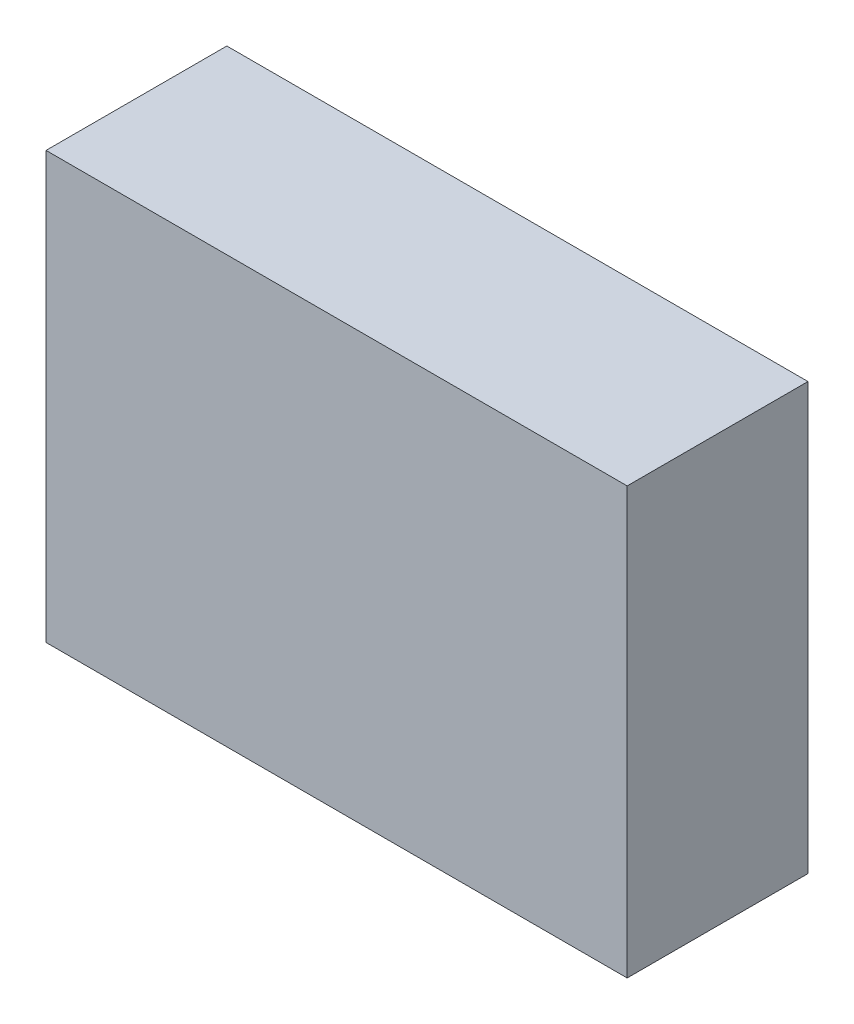
ISO-10303-21;
HEADER;
FILE_DESCRIPTION(('STEP AP214'),'2;1');
FILE_NAME('part.step','',(''),(''),'','','');
FILE_SCHEMA(('AUTOMOTIVE_DESIGN { 1 0 10303 214 1 1 1 1 }'));
ENDSEC;
DATA;
#1=APPLICATION_CONTEXT('core data for automotive mechanical design processes');
#2=APPLICATION_PROTOCOL_DEFINITION('international standard','automotive_design',2000,#1);
#3=PRODUCT_CONTEXT('',#1,'mechanical');
#4=PRODUCT('Part','Part','',(#3));
#5=PRODUCT_RELATED_PRODUCT_CATEGORY('part','',(#4));
#6=PRODUCT_DEFINITION_FORMATION('','',#4);
#7=PRODUCT_DEFINITION_CONTEXT('part definition',#1,'design');
#8=PRODUCT_DEFINITION('design','',#6,#7);
#9=PRODUCT_DEFINITION_SHAPE('','',#8);
#10=(LENGTH_UNIT() NAMED_UNIT(*) SI_UNIT(.MILLI.,.METRE.));
#11=(NAMED_UNIT(*) PLANE_ANGLE_UNIT() SI_UNIT($,.RADIAN.));
#12=(NAMED_UNIT(*) SI_UNIT($,.STERADIAN.) SOLID_ANGLE_UNIT());
#13=UNCERTAINTY_MEASURE_WITH_UNIT(LENGTH_MEASURE(1.E-05),#10,'distance_accuracy_value','');
#14=(GEOMETRIC_REPRESENTATION_CONTEXT(3) GLOBAL_UNCERTAINTY_ASSIGNED_CONTEXT((#13)) GLOBAL_UNIT_ASSIGNED_CONTEXT((#10,
#11,#12)) REPRESENTATION_CONTEXT('',''));
#15=CARTESIAN_POINT('',(0.,0.,0.));
#16=DIRECTION('',(0.,0.,1.));
#17=DIRECTION('',(1.,0.,0.));
#18=AXIS2_PLACEMENT_3D('',#15,#16,#17);
#19=CARTESIAN_POINT('',(-1.12500408197864,-0.824986841933026,-2.84112203121185));
#20=DIRECTION('',(-4.37113882867379E-08,-1.,0.));
#21=DIRECTION('',(1.,-4.37113882867379E-08,0.));
#22=AXIS2_PLACEMENT_3D('',#19,#20,#21);
#23=PLANE('',#22);
#24=DIRECTION('',(0.999999999999999,-4.37113882867379E-08,0.));
#25=VECTOR('',#24,1.);
#26=CARTESIAN_POINT('',(-1.12500408197864,-0.824986841933026,-2.84112203121185));
#27=LINE('',#26,#25);
#28=CARTESIAN_POINT('',(-1.12500408197864,-0.824986841933026,-2.84112203121185));
#29=VERTEX_POINT('',#28);
#30=CARTESIAN_POINT('',(1.12499591802136,-0.824986940283623,-2.84112203121185));
#31=VERTEX_POINT('',#30);
#32=EDGE_CURVE('E11',#29,#31,#27,.T.);
#33=ORIENTED_EDGE('',*,*,#32,.T.);
#34=DIRECTION('',(0.,0.,1.));
#35=VECTOR('',#34,1.);
#36=CARTESIAN_POINT('',(1.12499591802136,-0.824986940283649,-2.84112203121185));
#37=LINE('',#36,#35);
#38=CARTESIAN_POINT('',(1.12499591802136,-0.824986940283623,-2.14112091064453));
#39=VERTEX_POINT('',#38);
#40=EDGE_CURVE('E88',#31,#39,#37,.T.);
#41=ORIENTED_EDGE('',*,*,#40,.T.);
#42=DIRECTION('',(0.999999999999999,-4.37113882867379E-08,0.));
#43=VECTOR('',#42,1.);
#44=CARTESIAN_POINT('',(-1.12500408197864,-0.824986841933026,-2.14112091064453));
#45=LINE('',#44,#43);
#46=CARTESIAN_POINT('',(-1.12500408197864,-0.824986841933026,-2.14112091064453));
#47=VERTEX_POINT('',#46);
#48=EDGE_CURVE('E83',#47,#39,#45,.T.);
#49=ORIENTED_EDGE('',*,*,#48,.F.);
#50=DIRECTION('',(0.,0.,1.));
#51=VECTOR('',#50,1.);
#52=CARTESIAN_POINT('',(-1.12500408197864,-0.824986841933025,-2.84112203121185));
#53=LINE('',#52,#51);
#54=EDGE_CURVE('E72',#29,#47,#53,.T.);
#55=ORIENTED_EDGE('',*,*,#54,.F.);
#56=EDGE_LOOP('',(#33,#41,#49,#55));
#57=FACE_BOUND('',#56,.T.);
#58=ADVANCED_FACE('F17',(#57),#23,.T.);
#59=CARTESIAN_POINT('',(1.12499591802136,-0.824986940283623,-2.84112203121185));
#60=DIRECTION('',(1.,-4.37113882867379E-08,0.));
#61=DIRECTION('',(4.37113882867379E-08,1.,0.));
#62=AXIS2_PLACEMENT_3D('',#59,#60,#61);
#63=PLANE('',#62);
#64=DIRECTION('',(4.37113882503349E-08,0.999999999999999,0.));
#65=VECTOR('',#64,1.);
#66=CARTESIAN_POINT('',(1.12499591802136,-0.824986940283623,-2.84112203121185));
#67=LINE('',#66,#65);
#68=CARTESIAN_POINT('',(1.12499599014488,0.825006956200752,-2.84112203121185));
#69=VERTEX_POINT('',#68);
#70=EDGE_CURVE('E24',#31,#69,#67,.T.);
#71=ORIENTED_EDGE('',*,*,#70,.T.);
#72=DIRECTION('',(0.,0.,1.));
#73=VECTOR('',#72,1.);
#74=CARTESIAN_POINT('',(1.12499599014488,0.825006956200752,-2.84112203121185));
#75=LINE('',#74,#73);
#76=CARTESIAN_POINT('',(1.12499599014488,0.825006956200752,-2.14112091064453));
#77=VERTEX_POINT('',#76);
#78=EDGE_CURVE('E85',#69,#77,#75,.T.);
#79=ORIENTED_EDGE('',*,*,#78,.T.);
#80=DIRECTION('',(4.37113882503349E-08,0.999999999999999,0.));
#81=VECTOR('',#80,1.);
#82=CARTESIAN_POINT('',(1.12499591802136,-0.824986940283623,-2.14112091064453));
#83=LINE('',#82,#81);
#84=EDGE_CURVE('E66',#39,#77,#83,.T.);
#85=ORIENTED_EDGE('',*,*,#84,.F.);
#86=ORIENTED_EDGE('',*,*,#40,.F.);
#87=EDGE_LOOP('',(#71,#79,#85,#86));
#88=FACE_BOUND('',#87,.T.);
#89=ADVANCED_FACE('F89',(#88),#63,.T.);
#90=CARTESIAN_POINT('',(1.12499599014488,0.825006956200752,-2.84112203121185));
#91=DIRECTION('',(4.37113882867379E-08,1.,0.));
#92=DIRECTION('',(-1.,4.37113882867379E-08,0.));
#93=AXIS2_PLACEMENT_3D('',#90,#91,#92);
#94=PLANE('',#93);
#95=DIRECTION('',(-0.999999999999999,4.37113882867379E-08,0.));
#96=VECTOR('',#95,1.);
#97=CARTESIAN_POINT('',(1.12499599014488,0.825006956200752,-2.84112203121185));
#98=LINE('',#97,#96);
#99=CARTESIAN_POINT('',(-1.12500400985512,0.82500705455135,-2.84112203121185));
#100=VERTEX_POINT('',#99);
#101=EDGE_CURVE('E62',#69,#100,#98,.T.);
#102=ORIENTED_EDGE('',*,*,#101,.T.);
#103=DIRECTION('',(0.,0.,1.));
#104=VECTOR('',#103,1.);
#105=CARTESIAN_POINT('',(-1.12500400985512,0.825007054551376,-2.84112203121185));
#106=LINE('',#105,#104);
#107=CARTESIAN_POINT('',(-1.12500400985512,0.82500705455135,-2.14112091064453));
#108=VERTEX_POINT('',#107);
#109=EDGE_CURVE('E55',#100,#108,#106,.T.);
#110=ORIENTED_EDGE('',*,*,#109,.T.);
#111=DIRECTION('',(-0.999999999999999,4.37113882867379E-08,0.));
#112=VECTOR('',#111,1.);
#113=CARTESIAN_POINT('',(1.12499599014488,0.825006956200752,-2.14112091064453));
#114=LINE('',#113,#112);
#115=EDGE_CURVE('E59',#77,#108,#114,.T.);
#116=ORIENTED_EDGE('',*,*,#115,.F.);
#117=ORIENTED_EDGE('',*,*,#78,.F.);
#118=EDGE_LOOP('',(#102,#110,#116,#117));
#119=FACE_BOUND('',#118,.T.);
#120=ADVANCED_FACE('F57',(#119),#94,.T.);
#121=CARTESIAN_POINT('',(-1.12500400985512,0.82500705455135,-2.84112203121185));
#122=DIRECTION('',(-1.,4.37113882867379E-08,0.));
#123=DIRECTION('',(-4.37113882867379E-08,-1.,0.));
#124=AXIS2_PLACEMENT_3D('',#121,#122,#123);
#125=PLANE('',#124);
#126=DIRECTION('',(-4.37113882503349E-08,-0.999999999999999,0.));
#127=VECTOR('',#126,1.);
#128=CARTESIAN_POINT('',(-1.12500400985512,0.82500705455135,-2.84112203121185));
#129=LINE('',#128,#127);
#130=EDGE_CURVE('E65',#100,#29,#129,.T.);
#131=ORIENTED_EDGE('',*,*,#130,.T.);
#132=ORIENTED_EDGE('',*,*,#54,.T.);
#133=DIRECTION('',(-4.37113882503349E-08,-0.999999999999999,0.));
#134=VECTOR('',#133,1.);
#135=CARTESIAN_POINT('',(-1.12500400985512,0.82500705455135,-2.14112091064453));
#136=LINE('',#135,#134);
#137=EDGE_CURVE('E70',#108,#47,#136,.T.);
#138=ORIENTED_EDGE('',*,*,#137,.F.);
#139=ORIENTED_EDGE('',*,*,#109,.F.);
#140=EDGE_LOOP('',(#131,#132,#138,#139));
#141=FACE_BOUND('',#140,.T.);
#142=ADVANCED_FACE('F71',(#141),#125,.T.);
#143=CARTESIAN_POINT('',(-118.999992370605,267.100006103516,-2.14112091064453));
#144=DIRECTION('',(0.,0.,1.));
#145=DIRECTION('',(-4.37113882867379E-08,-1.,0.));
#146=AXIS2_PLACEMENT_3D('',#143,#144,#145);
#147=PLANE('',#146);
#148=ORIENTED_EDGE('',*,*,#48,.T.);
#149=ORIENTED_EDGE('',*,*,#84,.T.);
#150=ORIENTED_EDGE('',*,*,#115,.T.);
#151=ORIENTED_EDGE('',*,*,#137,.T.);
#152=EDGE_LOOP('',(#148,#149,#150,#151));
#153=FACE_BOUND('',#152,.T.);
#154=ADVANCED_FACE('F76',(#153),#147,.T.);
#155=CARTESIAN_POINT('',(-118.999992370605,267.100006103516,-2.84112203121185));
#156=DIRECTION('',(0.,0.,1.));
#157=DIRECTION('',(-4.37113882867379E-08,-1.,0.));
#158=AXIS2_PLACEMENT_3D('',#155,#156,#157);
#159=PLANE('',#158);
#160=ORIENTED_EDGE('',*,*,#130,.F.);
#161=ORIENTED_EDGE('',*,*,#101,.F.);
#162=ORIENTED_EDGE('',*,*,#70,.F.);
#163=ORIENTED_EDGE('',*,*,#32,.F.);
#164=EDGE_LOOP('',(#160,#161,#162,#163));
#165=FACE_BOUND('',#164,.T.);
#166=ADVANCED_FACE('F91',(#165),#159,.F.);
#167=CLOSED_SHELL('',(#58,#89,#120,#142,#154,#166));
#168=MANIFOLD_SOLID_BREP('B1',#167);
#169=ADVANCED_BREP_SHAPE_REPRESENTATION('',(#18,#168),#14);
#170=SHAPE_DEFINITION_REPRESENTATION(#9,#169);
ENDSEC;
END-ISO-10303-21;
